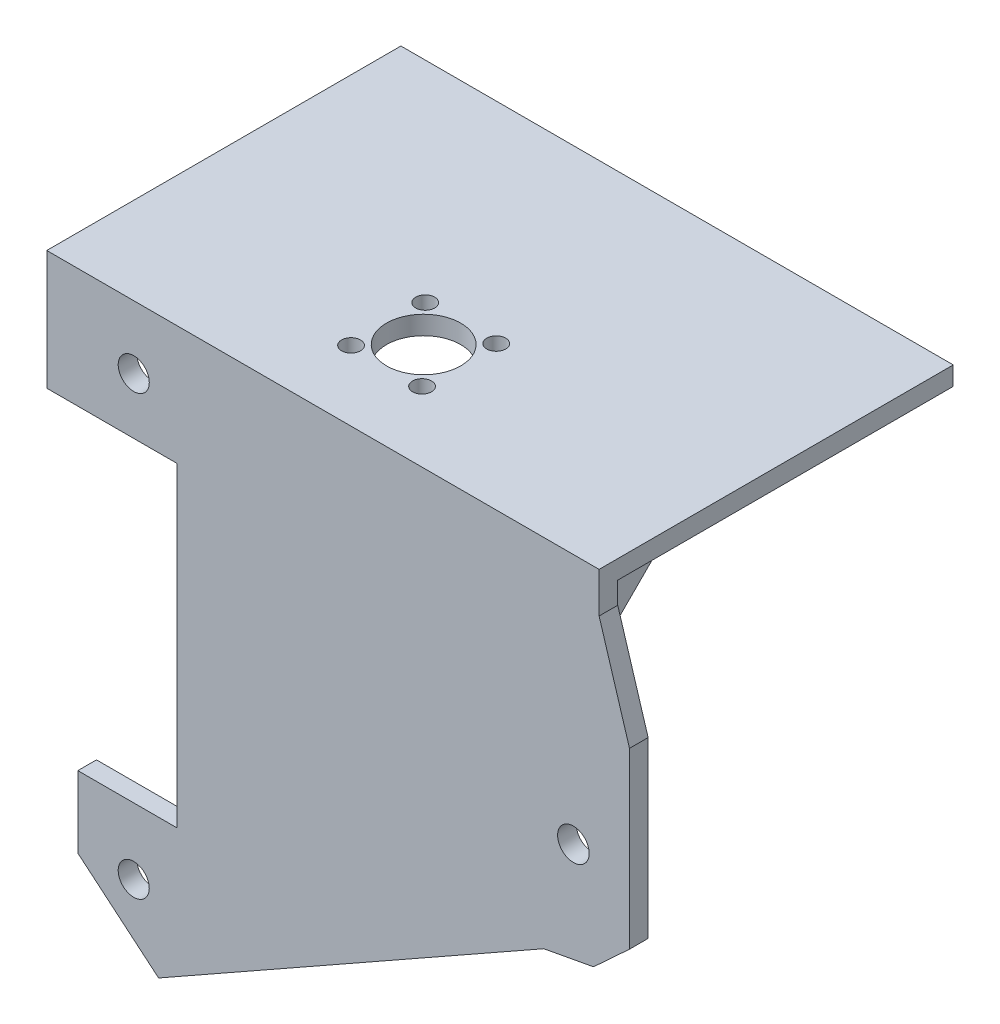
ISO-10303-21;
HEADER;
FILE_DESCRIPTION(('STEP AP214'),'2;1');
FILE_NAME('part.step','',(''),(''),'','','');
FILE_SCHEMA(('AUTOMOTIVE_DESIGN { 1 0 10303 214 1 1 1 1 }'));
ENDSEC;
DATA;
#1=APPLICATION_CONTEXT('core data for automotive mechanical design processes');
#2=APPLICATION_PROTOCOL_DEFINITION('international standard','automotive_design',2000,#1);
#3=PRODUCT_CONTEXT('',#1,'mechanical');
#4=PRODUCT('Part','Part','',(#3));
#5=PRODUCT_RELATED_PRODUCT_CATEGORY('part','',(#4));
#6=PRODUCT_DEFINITION_FORMATION('','',#4);
#7=PRODUCT_DEFINITION_CONTEXT('part definition',#1,'design');
#8=PRODUCT_DEFINITION('design','',#6,#7);
#9=PRODUCT_DEFINITION_SHAPE('','',#8);
#10=(LENGTH_UNIT() NAMED_UNIT(*) SI_UNIT(.MILLI.,.METRE.));
#11=(NAMED_UNIT(*) PLANE_ANGLE_UNIT() SI_UNIT($,.RADIAN.));
#12=(NAMED_UNIT(*) SI_UNIT($,.STERADIAN.) SOLID_ANGLE_UNIT());
#13=UNCERTAINTY_MEASURE_WITH_UNIT(LENGTH_MEASURE(1.E-05),#10,'distance_accuracy_value','');
#14=(GEOMETRIC_REPRESENTATION_CONTEXT(3) GLOBAL_UNCERTAINTY_ASSIGNED_CONTEXT((#13)) GLOBAL_UNIT_ASSIGNED_CONTEXT((#10,
#11,#12)) REPRESENTATION_CONTEXT('',''));
#15=CARTESIAN_POINT('',(0.,0.,0.));
#16=DIRECTION('',(0.,0.,1.));
#17=DIRECTION('',(1.,0.,0.));
#18=AXIS2_PLACEMENT_3D('',#15,#16,#17);
#19=CARTESIAN_POINT('',(1.39999999999998,-11.5,0.));
#20=DIRECTION('',(0.,-0.707106781186547,-0.707106781186548));
#21=DIRECTION('',(0.,0.707106781186548,-0.707106781186547));
#22=AXIS2_PLACEMENT_3D('',#19,#20,#21);
#23=PLANE('',#22);
#24=DIRECTION('',(1.,0.,0.));
#25=VECTOR('',#24,1.);
#26=CARTESIAN_POINT('',(1.39999999999998,-11.5,0.));
#27=LINE('',#26,#25);
#28=CARTESIAN_POINT('',(81.4,-11.5,0.));
#29=VERTEX_POINT('',#28);
#30=CARTESIAN_POINT('',(85.9,-11.5,0.));
#31=VERTEX_POINT('',#30);
#32=EDGE_CURVE('E195',#29,#31,#27,.T.);
#33=ORIENTED_EDGE('',*,*,#32,.F.);
#34=DIRECTION('',(0.,0.707106781186548,-0.707106781186547));
#35=VECTOR('',#34,1.);
#36=CARTESIAN_POINT('',(81.4,-11.5,0.));
#37=LINE('',#36,#35);
#38=CARTESIAN_POINT('',(81.4,0.,-11.5));
#39=VERTEX_POINT('',#38);
#40=EDGE_CURVE('E11',#29,#39,#37,.T.);
#41=ORIENTED_EDGE('',*,*,#40,.T.);
#42=DIRECTION('',(1.,0.,0.));
#43=VECTOR('',#42,1.);
#44=CARTESIAN_POINT('',(1.39999999999998,0.,-11.5));
#45=LINE('',#44,#43);
#46=CARTESIAN_POINT('',(85.9,0.,-11.5));
#47=VERTEX_POINT('',#46);
#48=EDGE_CURVE('E204',#39,#47,#45,.T.);
#49=ORIENTED_EDGE('',*,*,#48,.T.);
#50=DIRECTION('',(0.,0.707106781186548,-0.707106781186547));
#51=VECTOR('',#50,1.);
#52=CARTESIAN_POINT('',(85.9,-11.5,0.));
#53=LINE('',#52,#51);
#54=EDGE_CURVE('E209',#31,#47,#53,.T.);
#55=ORIENTED_EDGE('',*,*,#54,.F.);
#56=EDGE_LOOP('',(#33,#41,#49,#55));
#57=FACE_BOUND('',#56,.T.);
#58=ADVANCED_FACE('F33',(#57),#23,.T.);
#59=CARTESIAN_POINT('',(1.39999999999998,0.,-11.5));
#60=VERTEX_POINT('',#59);
#61=CARTESIAN_POINT('',(6.39999999999999,0.,-11.5));
#62=VERTEX_POINT('',#61);
#63=EDGE_CURVE('E191',#60,#62,#45,.T.);
#64=ORIENTED_EDGE('',*,*,#63,.T.);
#65=DIRECTION('',(0.,-0.707106781186548,0.707106781186547));
#66=VECTOR('',#65,1.);
#67=CARTESIAN_POINT('',(6.39999999999999,-11.5,0.));
#68=LINE('',#67,#66);
#69=CARTESIAN_POINT('',(6.39999999999999,-11.5,0.));
#70=VERTEX_POINT('',#69);
#71=EDGE_CURVE('E41',#62,#70,#68,.T.);
#72=ORIENTED_EDGE('',*,*,#71,.T.);
#73=CARTESIAN_POINT('',(1.39999999999998,-11.5,0.));
#74=VERTEX_POINT('',#73);
#75=EDGE_CURVE('E189',#74,#70,#27,.T.);
#76=ORIENTED_EDGE('',*,*,#75,.F.);
#77=DIRECTION('',(0.,0.707106781186548,-0.707106781186547));
#78=VECTOR('',#77,1.);
#79=CARTESIAN_POINT('',(1.39999999999998,-11.5,0.));
#80=LINE('',#79,#78);
#81=EDGE_CURVE('E382',#74,#60,#80,.T.);
#82=ORIENTED_EDGE('',*,*,#81,.T.);
#83=EDGE_LOOP('',(#64,#72,#76,#82));
#84=FACE_BOUND('',#83,.T.);
#85=ADVANCED_FACE('F187',(#84),#23,.T.);
#86=CARTESIAN_POINT('',(0.,0.,0.));
#87=DIRECTION('',(0.,0.,1.));
#88=DIRECTION('',(1.,0.,0.));
#89=AXIS2_PLACEMENT_3D('',#86,#87,#88);
#90=PLANE('',#89);
#91=CARTESIAN_POINT('',(14.,-77.66,0.));
#92=DIRECTION('',(0.,0.,1.));
#93=DIRECTION('',(1.,0.,0.));
#94=AXIS2_PLACEMENT_3D('',#91,#92,#93);
#95=CIRCLE('',#94,2.5);
#96=CARTESIAN_POINT('',(16.5,-77.66,0.));
#97=VERTEX_POINT('',#96);
#98=EDGE_CURVE('E408',#97,#97,#95,.T.);
#99=ORIENTED_EDGE('',*,*,#98,.T.);
#100=EDGE_LOOP('',(#99));
#101=FACE_BOUND('',#100,.T.);
#102=CARTESIAN_POINT('',(84.763,-37.386,0.));
#103=DIRECTION('',(0.,0.,1.));
#104=DIRECTION('',(1.,0.,0.));
#105=AXIS2_PLACEMENT_3D('',#102,#103,#104);
#106=CIRCLE('',#105,2.54);
#107=CARTESIAN_POINT('',(87.303,-37.386,0.));
#108=VERTEX_POINT('',#107);
#109=EDGE_CURVE('E411',#108,#108,#106,.T.);
#110=ORIENTED_EDGE('',*,*,#109,.T.);
#111=EDGE_LOOP('',(#110));
#112=FACE_BOUND('',#111,.T.);
#113=CARTESIAN_POINT('',(14.,-7.16,0.));
#114=DIRECTION('',(0.,0.,1.));
#115=DIRECTION('',(1.,0.,0.));
#116=AXIS2_PLACEMENT_3D('',#113,#114,#115);
#117=CIRCLE('',#116,2.5);
#118=CARTESIAN_POINT('',(16.5,-7.16,0.));
#119=VERTEX_POINT('',#118);
#120=EDGE_CURVE('E414',#119,#119,#117,.T.);
#121=ORIENTED_EDGE('',*,*,#120,.T.);
#122=EDGE_LOOP('',(#121));
#123=FACE_BOUND('',#122,.T.);
#124=DIRECTION('',(0.,-1.,0.));
#125=VECTOR('',#124,1.);
#126=CARTESIAN_POINT('',(1.39999999999998,0.,0.));
#127=LINE('',#126,#125);
#128=CARTESIAN_POINT('',(1.39999999999998,0.,0.));
#129=VERTEX_POINT('',#128);
#130=EDGE_CURVE('E55',#129,#74,#127,.T.);
#131=ORIENTED_EDGE('',*,*,#130,.T.);
#132=ORIENTED_EDGE('',*,*,#75,.T.);
#133=DIRECTION('',(0.,1.,0.));
#134=VECTOR('',#133,1.);
#135=CARTESIAN_POINT('',(6.39999999999999,-11.5,0.));
#136=LINE('',#135,#134);
#137=CARTESIAN_POINT('',(6.39999999999999,0.,0.));
#138=VERTEX_POINT('',#137);
#139=EDGE_CURVE('E177',#70,#138,#136,.T.);
#140=ORIENTED_EDGE('',*,*,#139,.T.);
#141=DIRECTION('',(1.,0.,0.));
#142=VECTOR('',#141,1.);
#143=CARTESIAN_POINT('',(81.4,0.,0.));
#144=LINE('',#143,#142);
#145=CARTESIAN_POINT('',(81.4,0.,0.));
#146=VERTEX_POINT('',#145);
#147=EDGE_CURVE('E183',#138,#146,#144,.T.);
#148=ORIENTED_EDGE('',*,*,#147,.T.);
#149=DIRECTION('',(0.,-1.,0.));
#150=VECTOR('',#149,1.);
#151=CARTESIAN_POINT('',(81.4,-11.5,0.));
#152=LINE('',#151,#150);
#153=EDGE_CURVE('E48',#146,#29,#152,.T.);
#154=ORIENTED_EDGE('',*,*,#153,.T.);
#155=ORIENTED_EDGE('',*,*,#32,.T.);
#156=DIRECTION('',(0.,-1.,0.));
#157=VECTOR('',#156,1.);
#158=CARTESIAN_POINT('',(85.9,0.,0.));
#159=LINE('',#158,#157);
#160=CARTESIAN_POINT('',(85.9,0.,0.));
#161=VERTEX_POINT('',#160);
#162=EDGE_CURVE('E202',#161,#31,#159,.T.);
#163=ORIENTED_EDGE('',*,*,#162,.F.);
#164=DIRECTION('',(-1.,0.,0.));
#165=VECTOR('',#164,1.);
#166=CARTESIAN_POINT('',(0.,0.,0.));
#167=LINE('',#166,#165);
#168=CARTESIAN_POINT('',(88.9,0.,0.));
#169=VERTEX_POINT('',#168);
#170=EDGE_CURVE('E261',#169,#161,#167,.T.);
#171=ORIENTED_EDGE('',*,*,#170,.F.);
#172=DIRECTION('',(0.,1.,0.));
#173=VECTOR('',#172,1.);
#174=CARTESIAN_POINT('',(88.9,0.,0.));
#175=LINE('',#174,#173);
#176=CARTESIAN_POINT('',(88.9,-3.5,0.));
#177=VERTEX_POINT('',#176);
#178=EDGE_CURVE('E306',#177,#169,#175,.T.);
#179=ORIENTED_EDGE('',*,*,#178,.F.);
#180=DIRECTION('',(-0.292371704722738,0.956304755963035,0.));
#181=VECTOR('',#180,1.);
#182=CARTESIAN_POINT('',(88.9,-3.5,0.));
#183=LINE('',#182,#181);
#184=CARTESIAN_POINT('',(93.7916909033386,-19.5,0.));
#185=VERTEX_POINT('',#184);
#186=EDGE_CURVE('E304',#185,#177,#183,.T.);
#187=ORIENTED_EDGE('',*,*,#186,.F.);
#188=DIRECTION('',(0.,1.,0.));
#189=VECTOR('',#188,1.);
#190=CARTESIAN_POINT('',(93.7916909033386,-19.5,0.));
#191=LINE('',#190,#189);
#192=CARTESIAN_POINT('',(93.7916909033386,-47.5,0.));
#193=VERTEX_POINT('',#192);
#194=EDGE_CURVE('E302',#193,#185,#191,.T.);
#195=ORIENTED_EDGE('',*,*,#194,.F.);
#196=DIRECTION('',(0.734708955038992,0.678382452150343,0.));
#197=VECTOR('',#196,1.);
#198=CARTESIAN_POINT('',(88.,-52.84767059821,0.));
#199=LINE('',#198,#197);
#200=CARTESIAN_POINT('',(88.,-52.84767059821,0.));
#201=VERTEX_POINT('',#200);
#202=EDGE_CURVE('E300',#201,#193,#199,.T.);
#203=ORIENTED_EDGE('',*,*,#202,.F.);
#204=DIRECTION('',(0.983254907563954,0.182235525492152,0.));
#205=VECTOR('',#204,1.);
#206=CARTESIAN_POINT('',(80.,-54.3303829576624,0.));
#207=LINE('',#206,#205);
#208=CARTESIAN_POINT('',(80.,-54.3303829576624,0.));
#209=VERTEX_POINT('',#208);
#210=EDGE_CURVE('E298',#209,#201,#207,.T.);
#211=ORIENTED_EDGE('',*,*,#210,.F.);
#212=DIRECTION('',(0.870355695939897,0.492423560103472,0.));
#213=VECTOR('',#212,1.);
#214=CARTESIAN_POINT('',(18.,-89.4082952053046,0.));
#215=LINE('',#214,#213);
#216=CARTESIAN_POINT('',(18.,-89.4082952053046,0.));
#217=VERTEX_POINT('',#216);
#218=EDGE_CURVE('E296',#217,#209,#215,.T.);
#219=ORIENTED_EDGE('',*,*,#218,.F.);
#220=DIRECTION('',(0.76604444311898,-0.642787609686537,0.));
#221=VECTOR('',#220,1.);
#222=CARTESIAN_POINT('',(5.00000000000001,-78.5,0.));
#223=LINE('',#222,#221);
#224=CARTESIAN_POINT('',(5.00000000000001,-78.5,0.));
#225=VERTEX_POINT('',#224);
#226=EDGE_CURVE('E294',#225,#217,#223,.T.);
#227=ORIENTED_EDGE('',*,*,#226,.F.);
#228=DIRECTION('',(0.,-1.,0.));
#229=VECTOR('',#228,1.);
#230=CARTESIAN_POINT('',(5.00000000000001,-67.,0.));
#231=LINE('',#230,#229);
#232=CARTESIAN_POINT('',(5.00000000000001,-67.,0.));
#233=VERTEX_POINT('',#232);
#234=EDGE_CURVE('E292',#233,#225,#231,.T.);
#235=ORIENTED_EDGE('',*,*,#234,.F.);
#236=DIRECTION('',(-1.,0.,0.));
#237=VECTOR('',#236,1.);
#238=CARTESIAN_POINT('',(21.,-67.,0.));
#239=LINE('',#238,#237);
#240=CARTESIAN_POINT('',(21.,-67.,0.));
#241=VERTEX_POINT('',#240);
#242=EDGE_CURVE('E290',#241,#233,#239,.T.);
#243=ORIENTED_EDGE('',*,*,#242,.F.);
#244=DIRECTION('',(0.,-1.,0.));
#245=VECTOR('',#244,1.);
#246=CARTESIAN_POINT('',(21.,-16.2,0.));
#247=LINE('',#246,#245);
#248=CARTESIAN_POINT('',(21.,-16.2,0.));
#249=VERTEX_POINT('',#248);
#250=EDGE_CURVE('E288',#249,#241,#247,.T.);
#251=ORIENTED_EDGE('',*,*,#250,.F.);
#252=DIRECTION('',(1.,0.,0.));
#253=VECTOR('',#252,1.);
#254=CARTESIAN_POINT('',(0.,-16.2,0.));
#255=LINE('',#254,#253);
#256=CARTESIAN_POINT('',(0.,-16.2,0.));
#257=VERTEX_POINT('',#256);
#258=EDGE_CURVE('E286',#257,#249,#255,.T.);
#259=ORIENTED_EDGE('',*,*,#258,.F.);
#260=DIRECTION('',(0.,-1.,0.));
#261=VECTOR('',#260,1.);
#262=CARTESIAN_POINT('',(0.,0.,0.));
#263=LINE('',#262,#261);
#264=CARTESIAN_POINT('',(0.,0.,0.));
#265=VERTEX_POINT('',#264);
#266=EDGE_CURVE('E256',#265,#257,#263,.T.);
#267=ORIENTED_EDGE('',*,*,#266,.F.);
#268=EDGE_CURVE('E308',#129,#265,#167,.T.);
#269=ORIENTED_EDGE('',*,*,#268,.F.);
#270=EDGE_LOOP('',(#131,#132,#140,#148,#154,#155,#163,#171,#179,#187,#195,#203,#211,#219,#227,
#235,#243,#251,#259,#267,#269));
#271=FACE_BOUND('',#270,.T.);
#272=ADVANCED_FACE('F193',(#101,#112,#123,#271),#90,.F.);
#273=CARTESIAN_POINT('',(0.,0.,3.));
#274=DIRECTION('',(1.,0.,0.));
#275=DIRECTION('',(0.,1.,0.));
#276=AXIS2_PLACEMENT_3D('',#273,#274,#275);
#277=PLANE('',#276);
#278=ORIENTED_EDGE('',*,*,#266,.T.);
#279=DIRECTION('',(0.,0.,-1.));
#280=VECTOR('',#279,1.);
#281=CARTESIAN_POINT('',(0.,-16.2,3.));
#282=LINE('',#281,#280);
#283=CARTESIAN_POINT('',(0.,-16.2,3.));
#284=VERTEX_POINT('',#283);
#285=EDGE_CURVE('E192',#284,#257,#282,.T.);
#286=ORIENTED_EDGE('',*,*,#285,.F.);
#287=DIRECTION('',(0.,-1.,0.));
#288=VECTOR('',#287,1.);
#289=CARTESIAN_POINT('',(0.,0.,3.));
#290=LINE('',#289,#288);
#291=CARTESIAN_POINT('',(0.,3.,3.));
#292=VERTEX_POINT('',#291);
#293=EDGE_CURVE('E257',#292,#284,#290,.T.);
#294=ORIENTED_EDGE('',*,*,#293,.F.);
#295=DIRECTION('',(0.,0.,1.));
#296=VECTOR('',#295,1.);
#297=CARTESIAN_POINT('',(0.,3.,3.));
#298=LINE('',#297,#296);
#299=CARTESIAN_POINT('',(0.,3.,-54.));
#300=VERTEX_POINT('',#299);
#301=EDGE_CURVE('E234',#300,#292,#298,.T.);
#302=ORIENTED_EDGE('',*,*,#301,.F.);
#303=DIRECTION('',(0.,-1.,0.));
#304=VECTOR('',#303,1.);
#305=CARTESIAN_POINT('',(0.,3.,-54.));
#306=LINE('',#305,#304);
#307=CARTESIAN_POINT('',(0.,0.,-54.));
#308=VERTEX_POINT('',#307);
#309=EDGE_CURVE('E245',#300,#308,#306,.T.);
#310=ORIENTED_EDGE('',*,*,#309,.T.);
#311=DIRECTION('',(0.,0.,1.));
#312=VECTOR('',#311,1.);
#313=CARTESIAN_POINT('',(0.,0.,3.));
#314=LINE('',#313,#312);
#315=EDGE_CURVE('E231',#308,#265,#314,.T.);
#316=ORIENTED_EDGE('',*,*,#315,.T.);
#317=EDGE_LOOP('',(#278,#286,#294,#302,#310,#316));
#318=FACE_BOUND('',#317,.T.);
#319=ADVANCED_FACE('F35',(#318),#277,.F.);
#320=CARTESIAN_POINT('',(0.,-16.2,3.));
#321=DIRECTION('',(0.,1.,0.));
#322=DIRECTION('',(0.,0.,1.));
#323=AXIS2_PLACEMENT_3D('',#320,#321,#322);
#324=PLANE('',#323);
#325=ORIENTED_EDGE('',*,*,#258,.T.);
#326=DIRECTION('',(0.,0.,-1.));
#327=VECTOR('',#326,1.);
#328=CARTESIAN_POINT('',(21.,-16.2,3.));
#329=LINE('',#328,#327);
#330=CARTESIAN_POINT('',(21.,-16.2,3.));
#331=VERTEX_POINT('',#330);
#332=EDGE_CURVE('E337',#331,#249,#329,.T.);
#333=ORIENTED_EDGE('',*,*,#332,.F.);
#334=DIRECTION('',(1.,0.,0.));
#335=VECTOR('',#334,1.);
#336=CARTESIAN_POINT('',(0.,-16.2,3.));
#337=LINE('',#336,#335);
#338=EDGE_CURVE('E260',#284,#331,#337,.T.);
#339=ORIENTED_EDGE('',*,*,#338,.F.);
#340=ORIENTED_EDGE('',*,*,#285,.T.);
#341=EDGE_LOOP('',(#325,#333,#339,#340));
#342=FACE_BOUND('',#341,.T.);
#343=ADVANCED_FACE('F343',(#342),#324,.F.);
#344=CARTESIAN_POINT('',(21.,-16.2,3.));
#345=DIRECTION('',(1.,0.,0.));
#346=DIRECTION('',(0.,1.,0.));
#347=AXIS2_PLACEMENT_3D('',#344,#345,#346);
#348=PLANE('',#347);
#349=ORIENTED_EDGE('',*,*,#250,.T.);
#350=DIRECTION('',(0.,0.,-1.));
#351=VECTOR('',#350,1.);
#352=CARTESIAN_POINT('',(21.,-67.,3.));
#353=LINE('',#352,#351);
#354=CARTESIAN_POINT('',(21.,-67.,3.));
#355=VERTEX_POINT('',#354);
#356=EDGE_CURVE('E334',#355,#241,#353,.T.);
#357=ORIENTED_EDGE('',*,*,#356,.F.);
#358=DIRECTION('',(0.,-1.,0.));
#359=VECTOR('',#358,1.);
#360=CARTESIAN_POINT('',(21.,-16.2,3.));
#361=LINE('',#360,#359);
#362=EDGE_CURVE('E263',#331,#355,#361,.T.);
#363=ORIENTED_EDGE('',*,*,#362,.F.);
#364=ORIENTED_EDGE('',*,*,#332,.T.);
#365=EDGE_LOOP('',(#349,#357,#363,#364));
#366=FACE_BOUND('',#365,.T.);
#367=ADVANCED_FACE('F353',(#366),#348,.F.);
#368=CARTESIAN_POINT('',(21.,-67.,3.));
#369=DIRECTION('',(0.,-1.,0.));
#370=DIRECTION('',(0.,0.,-1.));
#371=AXIS2_PLACEMENT_3D('',#368,#369,#370);
#372=PLANE('',#371);
#373=ORIENTED_EDGE('',*,*,#242,.T.);
#374=DIRECTION('',(0.,0.,-1.));
#375=VECTOR('',#374,1.);
#376=CARTESIAN_POINT('',(5.00000000000001,-67.,3.));
#377=LINE('',#376,#375);
#378=CARTESIAN_POINT('',(5.00000000000001,-67.,3.));
#379=VERTEX_POINT('',#378);
#380=EDGE_CURVE('E331',#379,#233,#377,.T.);
#381=ORIENTED_EDGE('',*,*,#380,.F.);
#382=DIRECTION('',(-1.,0.,0.));
#383=VECTOR('',#382,1.);
#384=CARTESIAN_POINT('',(21.,-67.,3.));
#385=LINE('',#384,#383);
#386=EDGE_CURVE('E265',#355,#379,#385,.T.);
#387=ORIENTED_EDGE('',*,*,#386,.F.);
#388=ORIENTED_EDGE('',*,*,#356,.T.);
#389=EDGE_LOOP('',(#373,#381,#387,#388));
#390=FACE_BOUND('',#389,.T.);
#391=ADVANCED_FACE('F357',(#390),#372,.F.);
#392=CARTESIAN_POINT('',(5.00000000000001,-67.,3.));
#393=DIRECTION('',(1.,0.,0.));
#394=DIRECTION('',(0.,1.,0.));
#395=AXIS2_PLACEMENT_3D('',#392,#393,#394);
#396=PLANE('',#395);
#397=ORIENTED_EDGE('',*,*,#234,.T.);
#398=DIRECTION('',(0.,0.,-1.));
#399=VECTOR('',#398,1.);
#400=CARTESIAN_POINT('',(5.00000000000001,-78.5,3.));
#401=LINE('',#400,#399);
#402=CARTESIAN_POINT('',(5.00000000000001,-78.5,3.));
#403=VERTEX_POINT('',#402);
#404=EDGE_CURVE('E328',#403,#225,#401,.T.);
#405=ORIENTED_EDGE('',*,*,#404,.F.);
#406=DIRECTION('',(0.,-1.,0.));
#407=VECTOR('',#406,1.);
#408=CARTESIAN_POINT('',(5.00000000000001,-67.,3.));
#409=LINE('',#408,#407);
#410=EDGE_CURVE('E267',#379,#403,#409,.T.);
#411=ORIENTED_EDGE('',*,*,#410,.F.);
#412=ORIENTED_EDGE('',*,*,#380,.T.);
#413=EDGE_LOOP('',(#397,#405,#411,#412));
#414=FACE_BOUND('',#413,.T.);
#415=ADVANCED_FACE('F676',(#414),#396,.F.);
#416=CARTESIAN_POINT('',(5.00000000000001,-78.5,3.));
#417=DIRECTION('',(0.642787609686537,0.76604444311898,0.));
#418=DIRECTION('',(-0.76604444311898,0.642787609686537,0.));
#419=AXIS2_PLACEMENT_3D('',#416,#417,#418);
#420=PLANE('',#419);
#421=ORIENTED_EDGE('',*,*,#226,.T.);
#422=DIRECTION('',(0.,0.,-1.));
#423=VECTOR('',#422,1.);
#424=CARTESIAN_POINT('',(18.,-89.4082952053046,3.));
#425=LINE('',#424,#423);
#426=CARTESIAN_POINT('',(18.,-89.4082952053046,3.));
#427=VERTEX_POINT('',#426);
#428=EDGE_CURVE('E325',#427,#217,#425,.T.);
#429=ORIENTED_EDGE('',*,*,#428,.F.);
#430=DIRECTION('',(0.76604444311898,-0.642787609686537,0.));
#431=VECTOR('',#430,1.);
#432=CARTESIAN_POINT('',(5.00000000000001,-78.5,3.));
#433=LINE('',#432,#431);
#434=EDGE_CURVE('E269',#403,#427,#433,.T.);
#435=ORIENTED_EDGE('',*,*,#434,.F.);
#436=ORIENTED_EDGE('',*,*,#404,.T.);
#437=EDGE_LOOP('',(#421,#429,#435,#436));
#438=FACE_BOUND('',#437,.T.);
#439=ADVANCED_FACE('F666',(#438),#420,.F.);
#440=CARTESIAN_POINT('',(18.,-89.4082952053046,3.));
#441=DIRECTION('',(-0.492423560103472,0.870355695939897,0.));
#442=DIRECTION('',(-0.870355695939897,-0.492423560103472,0.));
#443=AXIS2_PLACEMENT_3D('',#440,#441,#442);
#444=PLANE('',#443);
#445=ORIENTED_EDGE('',*,*,#218,.T.);
#446=DIRECTION('',(0.,0.,-1.));
#447=VECTOR('',#446,1.);
#448=CARTESIAN_POINT('',(80.,-54.3303829576624,3.));
#449=LINE('',#448,#447);
#450=CARTESIAN_POINT('',(80.,-54.3303829576624,3.));
#451=VERTEX_POINT('',#450);
#452=EDGE_CURVE('E322',#451,#209,#449,.T.);
#453=ORIENTED_EDGE('',*,*,#452,.F.);
#454=DIRECTION('',(0.870355695939897,0.492423560103472,0.));
#455=VECTOR('',#454,1.);
#456=CARTESIAN_POINT('',(18.,-89.4082952053046,3.));
#457=LINE('',#456,#455);
#458=EDGE_CURVE('E271',#427,#451,#457,.T.);
#459=ORIENTED_EDGE('',*,*,#458,.F.);
#460=ORIENTED_EDGE('',*,*,#428,.T.);
#461=EDGE_LOOP('',(#445,#453,#459,#460));
#462=FACE_BOUND('',#461,.T.);
#463=ADVANCED_FACE('F656',(#462),#444,.F.);
#464=CARTESIAN_POINT('',(80.,-54.3303829576624,3.));
#465=DIRECTION('',(-0.182235525492152,0.983254907563954,0.));
#466=DIRECTION('',(-0.983254907563954,-0.182235525492152,0.));
#467=AXIS2_PLACEMENT_3D('',#464,#465,#466);
#468=PLANE('',#467);
#469=ORIENTED_EDGE('',*,*,#210,.T.);
#470=DIRECTION('',(0.,0.,-1.));
#471=VECTOR('',#470,1.);
#472=CARTESIAN_POINT('',(88.,-52.84767059821,3.));
#473=LINE('',#472,#471);
#474=CARTESIAN_POINT('',(88.,-52.84767059821,3.));
#475=VERTEX_POINT('',#474);
#476=EDGE_CURVE('E319',#475,#201,#473,.T.);
#477=ORIENTED_EDGE('',*,*,#476,.F.);
#478=DIRECTION('',(0.983254907563954,0.182235525492152,0.));
#479=VECTOR('',#478,1.);
#480=CARTESIAN_POINT('',(80.,-54.3303829576624,3.));
#481=LINE('',#480,#479);
#482=EDGE_CURVE('E273',#451,#475,#481,.T.);
#483=ORIENTED_EDGE('',*,*,#482,.F.);
#484=ORIENTED_EDGE('',*,*,#452,.T.);
#485=EDGE_LOOP('',(#469,#477,#483,#484));
#486=FACE_BOUND('',#485,.T.);
#487=ADVANCED_FACE('F646',(#486),#468,.F.);
#488=CARTESIAN_POINT('',(88.,-52.84767059821,3.));
#489=DIRECTION('',(-0.678382452150343,0.734708955038992,0.));
#490=DIRECTION('',(-0.734708955038992,-0.678382452150343,0.));
#491=AXIS2_PLACEMENT_3D('',#488,#489,#490);
#492=PLANE('',#491);
#493=ORIENTED_EDGE('',*,*,#202,.T.);
#494=DIRECTION('',(0.,0.,-1.));
#495=VECTOR('',#494,1.);
#496=CARTESIAN_POINT('',(93.7916909033386,-47.5,3.));
#497=LINE('',#496,#495);
#498=CARTESIAN_POINT('',(93.7916909033386,-47.5,3.));
#499=VERTEX_POINT('',#498);
#500=EDGE_CURVE('E316',#499,#193,#497,.T.);
#501=ORIENTED_EDGE('',*,*,#500,.F.);
#502=DIRECTION('',(0.734708955038992,0.678382452150343,0.));
#503=VECTOR('',#502,1.);
#504=CARTESIAN_POINT('',(88.,-52.84767059821,3.));
#505=LINE('',#504,#503);
#506=EDGE_CURVE('E275',#475,#499,#505,.T.);
#507=ORIENTED_EDGE('',*,*,#506,.F.);
#508=ORIENTED_EDGE('',*,*,#476,.T.);
#509=EDGE_LOOP('',(#493,#501,#507,#508));
#510=FACE_BOUND('',#509,.T.);
#511=ADVANCED_FACE('F636',(#510),#492,.F.);
#512=CARTESIAN_POINT('',(93.7916909033386,-19.5,3.));
#513=DIRECTION('',(-1.,0.,0.));
#514=DIRECTION('',(0.,-1.,0.));
#515=AXIS2_PLACEMENT_3D('',#512,#513,#514);
#516=PLANE('',#515);
#517=ORIENTED_EDGE('',*,*,#194,.T.);
#518=DIRECTION('',(0.,0.,-1.));
#519=VECTOR('',#518,1.);
#520=CARTESIAN_POINT('',(93.7916909033386,-19.5,3.));
#521=LINE('',#520,#519);
#522=CARTESIAN_POINT('',(93.7916909033386,-19.5,3.));
#523=VERTEX_POINT('',#522);
#524=EDGE_CURVE('E313',#523,#185,#521,.T.);
#525=ORIENTED_EDGE('',*,*,#524,.F.);
#526=DIRECTION('',(0.,1.,0.));
#527=VECTOR('',#526,1.);
#528=CARTESIAN_POINT('',(93.7916909033386,-19.5,3.));
#529=LINE('',#528,#527);
#530=EDGE_CURVE('E277',#499,#523,#529,.T.);
#531=ORIENTED_EDGE('',*,*,#530,.F.);
#532=ORIENTED_EDGE('',*,*,#500,.T.);
#533=EDGE_LOOP('',(#517,#525,#531,#532));
#534=FACE_BOUND('',#533,.T.);
#535=ADVANCED_FACE('F626',(#534),#516,.F.);
#536=CARTESIAN_POINT('',(88.9,-3.5,3.));
#537=DIRECTION('',(-0.956304755963035,-0.292371704722738,0.));
#538=DIRECTION('',(0.292371704722738,-0.956304755963035,0.));
#539=AXIS2_PLACEMENT_3D('',#536,#537,#538);
#540=PLANE('',#539);
#541=ORIENTED_EDGE('',*,*,#186,.T.);
#542=DIRECTION('',(0.,0.,-1.));
#543=VECTOR('',#542,1.);
#544=CARTESIAN_POINT('',(88.9,-3.5,3.));
#545=LINE('',#544,#543);
#546=CARTESIAN_POINT('',(88.9,-3.5,3.));
#547=VERTEX_POINT('',#546);
#548=EDGE_CURVE('E283',#547,#177,#545,.T.);
#549=ORIENTED_EDGE('',*,*,#548,.F.);
#550=DIRECTION('',(-0.292371704722738,0.956304755963035,0.));
#551=VECTOR('',#550,1.);
#552=CARTESIAN_POINT('',(88.9,-3.5,3.));
#553=LINE('',#552,#551);
#554=EDGE_CURVE('E279',#523,#547,#553,.T.);
#555=ORIENTED_EDGE('',*,*,#554,.F.);
#556=ORIENTED_EDGE('',*,*,#524,.T.);
#557=EDGE_LOOP('',(#541,#549,#555,#556));
#558=FACE_BOUND('',#557,.T.);
#559=ADVANCED_FACE('F610',(#558),#540,.F.);
#560=CARTESIAN_POINT('',(88.9,0.,3.));
#561=DIRECTION('',(-1.,0.,0.));
#562=DIRECTION('',(0.,0.,1.));
#563=AXIS2_PLACEMENT_3D('',#560,#561,#562);
#564=PLANE('',#563);
#565=ORIENTED_EDGE('',*,*,#178,.T.);
#566=DIRECTION('',(0.,0.,-1.));
#567=VECTOR('',#566,1.);
#568=CARTESIAN_POINT('',(88.9,0.,3.));
#569=LINE('',#568,#567);
#570=CARTESIAN_POINT('',(88.9,0.,-54.));
#571=VERTEX_POINT('',#570);
#572=EDGE_CURVE('E248',#169,#571,#569,.T.);
#573=ORIENTED_EDGE('',*,*,#572,.T.);
#574=DIRECTION('',(0.,-1.,0.));
#575=VECTOR('',#574,1.);
#576=CARTESIAN_POINT('',(88.9,3.,-54.));
#577=LINE('',#576,#575);
#578=CARTESIAN_POINT('',(88.9,3.,-54.));
#579=VERTEX_POINT('',#578);
#580=EDGE_CURVE('E253',#579,#571,#577,.T.);
#581=ORIENTED_EDGE('',*,*,#580,.F.);
#582=DIRECTION('',(0.,0.,-1.));
#583=VECTOR('',#582,1.);
#584=CARTESIAN_POINT('',(88.9,3.,3.));
#585=LINE('',#584,#583);
#586=CARTESIAN_POINT('',(88.9,3.,3.));
#587=VERTEX_POINT('',#586);
#588=EDGE_CURVE('E241',#587,#579,#585,.T.);
#589=ORIENTED_EDGE('',*,*,#588,.F.);
#590=DIRECTION('',(0.,1.,0.));
#591=VECTOR('',#590,1.);
#592=CARTESIAN_POINT('',(88.9,0.,3.));
#593=LINE('',#592,#591);
#594=EDGE_CURVE('E281',#547,#587,#593,.T.);
#595=ORIENTED_EDGE('',*,*,#594,.F.);
#596=ORIENTED_EDGE('',*,*,#548,.T.);
#597=EDGE_LOOP('',(#565,#573,#581,#589,#595,#596));
#598=FACE_BOUND('',#597,.T.);
#599=ADVANCED_FACE('F432',(#598),#564,.F.);
#600=CARTESIAN_POINT('',(0.,0.,3.));
#601=DIRECTION('',(0.,0.,1.));
#602=DIRECTION('',(1.,0.,0.));
#603=AXIS2_PLACEMENT_3D('',#600,#601,#602);
#604=PLANE('',#603);
#605=CARTESIAN_POINT('',(14.,-77.66,3.));
#606=DIRECTION('',(0.,0.,1.));
#607=DIRECTION('',(1.,0.,0.));
#608=AXIS2_PLACEMENT_3D('',#605,#606,#607);
#609=CIRCLE('',#608,2.5);
#610=CARTESIAN_POINT('',(16.5,-77.66,3.));
#611=VERTEX_POINT('',#610);
#612=EDGE_CURVE('E417',#611,#611,#609,.T.);
#613=ORIENTED_EDGE('',*,*,#612,.F.);
#614=EDGE_LOOP('',(#613));
#615=FACE_BOUND('',#614,.T.);
#616=CARTESIAN_POINT('',(84.763,-37.386,3.));
#617=DIRECTION('',(0.,0.,1.));
#618=DIRECTION('',(1.,0.,0.));
#619=AXIS2_PLACEMENT_3D('',#616,#617,#618);
#620=CIRCLE('',#619,2.54);
#621=CARTESIAN_POINT('',(87.303,-37.386,3.));
#622=VERTEX_POINT('',#621);
#623=EDGE_CURVE('E421',#622,#622,#620,.T.);
#624=ORIENTED_EDGE('',*,*,#623,.F.);
#625=EDGE_LOOP('',(#624));
#626=FACE_BOUND('',#625,.T.);
#627=CARTESIAN_POINT('',(14.,-7.16,3.));
#628=DIRECTION('',(0.,0.,1.));
#629=DIRECTION('',(1.,0.,0.));
#630=AXIS2_PLACEMENT_3D('',#627,#628,#629);
#631=CIRCLE('',#630,2.5);
#632=CARTESIAN_POINT('',(16.5,-7.16,3.));
#633=VERTEX_POINT('',#632);
#634=EDGE_CURVE('E418',#633,#633,#631,.T.);
#635=ORIENTED_EDGE('',*,*,#634,.F.);
#636=EDGE_LOOP('',(#635));
#637=FACE_BOUND('',#636,.T.);
#638=ORIENTED_EDGE('',*,*,#293,.T.);
#639=ORIENTED_EDGE('',*,*,#338,.T.);
#640=ORIENTED_EDGE('',*,*,#362,.T.);
#641=ORIENTED_EDGE('',*,*,#386,.T.);
#642=ORIENTED_EDGE('',*,*,#410,.T.);
#643=ORIENTED_EDGE('',*,*,#434,.T.);
#644=ORIENTED_EDGE('',*,*,#458,.T.);
#645=ORIENTED_EDGE('',*,*,#482,.T.);
#646=ORIENTED_EDGE('',*,*,#506,.T.);
#647=ORIENTED_EDGE('',*,*,#530,.T.);
#648=ORIENTED_EDGE('',*,*,#554,.T.);
#649=ORIENTED_EDGE('',*,*,#594,.T.);
#650=DIRECTION('',(1.,0.,0.));
#651=VECTOR('',#650,1.);
#652=CARTESIAN_POINT('',(0.,3.,3.));
#653=LINE('',#652,#651);
#654=EDGE_CURVE('E237',#292,#587,#653,.T.);
#655=ORIENTED_EDGE('',*,*,#654,.F.);
#656=EDGE_LOOP('',(#638,#639,#640,#641,#642,#643,#644,#645,#646,#647,#648,#649,#655));
#657=FACE_BOUND('',#656,.T.);
#658=ADVANCED_FACE('F361',(#615,#626,#637,#657),#604,.T.);
#659=CARTESIAN_POINT('',(0.,3.,0.));
#660=DIRECTION('',(0.,-1.,0.));
#661=DIRECTION('',(0.,0.,-1.));
#662=AXIS2_PLACEMENT_3D('',#659,#660,#661);
#663=PLANE('',#662);
#664=ORIENTED_EDGE('',*,*,#301,.T.);
#665=ORIENTED_EDGE('',*,*,#654,.T.);
#666=ORIENTED_EDGE('',*,*,#588,.T.);
#667=DIRECTION('',(-1.,0.,0.));
#668=VECTOR('',#667,1.);
#669=CARTESIAN_POINT('',(0.,3.,-54.));
#670=LINE('',#669,#668);
#671=EDGE_CURVE('E243',#579,#300,#670,.T.);
#672=ORIENTED_EDGE('',*,*,#671,.T.);
#673=EDGE_LOOP('',(#664,#665,#666,#672));
#674=FACE_BOUND('',#673,.T.);
#675=CARTESIAN_POINT('',(43.434,3.,-14.224));
#676=DIRECTION('',(0.,1.,0.));
#677=DIRECTION('',(0.,0.,1.));
#678=AXIS2_PLACEMENT_3D('',#675,#676,#677);
#679=CIRCLE('',#678,5.969);
#680=CARTESIAN_POINT('',(43.434,3.,-8.25499999999999));
#681=VERTEX_POINT('',#680);
#682=EDGE_CURVE('E228',#681,#681,#679,.T.);
#683=ORIENTED_EDGE('',*,*,#682,.F.);
#684=EDGE_LOOP('',(#683));
#685=FACE_BOUND('',#684,.T.);
#686=CARTESIAN_POINT('',(37.719,3.,-20.193));
#687=DIRECTION('',(0.,1.,0.));
#688=DIRECTION('',(0.,0.,1.));
#689=AXIS2_PLACEMENT_3D('',#686,#687,#688);
#690=CIRCLE('',#689,1.524);
#691=CARTESIAN_POINT('',(37.719,3.,-18.669));
#692=VERTEX_POINT('',#691);
#693=EDGE_CURVE('E222',#692,#692,#690,.T.);
#694=ORIENTED_EDGE('',*,*,#693,.F.);
#695=EDGE_LOOP('',(#694));
#696=FACE_BOUND('',#695,.T.);
#697=CARTESIAN_POINT('',(49.149,3.,-20.193));
#698=DIRECTION('',(0.,1.,0.));
#699=DIRECTION('',(0.,0.,1.));
#700=AXIS2_PLACEMENT_3D('',#697,#698,#699);
#701=CIRCLE('',#700,1.524);
#702=CARTESIAN_POINT('',(49.149,3.,-18.669));
#703=VERTEX_POINT('',#702);
#704=EDGE_CURVE('E216',#703,#703,#701,.T.);
#705=ORIENTED_EDGE('',*,*,#704,.F.);
#706=EDGE_LOOP('',(#705));
#707=FACE_BOUND('',#706,.T.);
#708=CARTESIAN_POINT('',(37.719,3.,-8.25499999999999));
#709=DIRECTION('',(0.,1.,0.));
#710=DIRECTION('',(0.,0.,1.));
#711=AXIS2_PLACEMENT_3D('',#708,#709,#710);
#712=CIRCLE('',#711,1.524);
#713=CARTESIAN_POINT('',(37.719,3.,-6.73099999999999));
#714=VERTEX_POINT('',#713);
#715=EDGE_CURVE('E198',#714,#714,#712,.T.);
#716=ORIENTED_EDGE('',*,*,#715,.F.);
#717=EDGE_LOOP('',(#716));
#718=FACE_BOUND('',#717,.T.);
#719=CARTESIAN_POINT('',(49.149,3.,-8.25499999999999));
#720=DIRECTION('',(0.,1.,0.));
#721=DIRECTION('',(0.,0.,1.));
#722=AXIS2_PLACEMENT_3D('',#719,#720,#721);
#723=CIRCLE('',#722,1.524);
#724=CARTESIAN_POINT('',(49.149,3.,-6.73099999999999));
#725=VERTEX_POINT('',#724);
#726=EDGE_CURVE('E194',#725,#725,#723,.T.);
#727=ORIENTED_EDGE('',*,*,#726,.F.);
#728=EDGE_LOOP('',(#727));
#729=FACE_BOUND('',#728,.T.);
#730=ADVANCED_FACE('F367',(#674,#685,#696,#707,#718,#729),#663,.F.);
#731=CARTESIAN_POINT('',(0.,0.,0.));
#732=DIRECTION('',(0.,-1.,0.));
#733=DIRECTION('',(0.,0.,-1.));
#734=AXIS2_PLACEMENT_3D('',#731,#732,#733);
#735=PLANE('',#734);
#736=ORIENTED_EDGE('',*,*,#315,.F.);
#737=DIRECTION('',(-1.,0.,0.));
#738=VECTOR('',#737,1.);
#739=CARTESIAN_POINT('',(0.,0.,-54.));
#740=LINE('',#739,#738);
#741=EDGE_CURVE('E238',#571,#308,#740,.T.);
#742=ORIENTED_EDGE('',*,*,#741,.F.);
#743=ORIENTED_EDGE('',*,*,#572,.F.);
#744=ORIENTED_EDGE('',*,*,#170,.T.);
#745=DIRECTION('',(0.,0.,1.));
#746=VECTOR('',#745,1.);
#747=CARTESIAN_POINT('',(85.9,0.,-11.5));
#748=LINE('',#747,#746);
#749=EDGE_CURVE('E389',#47,#161,#748,.T.);
#750=ORIENTED_EDGE('',*,*,#749,.F.);
#751=ORIENTED_EDGE('',*,*,#48,.F.);
#752=DIRECTION('',(0.,0.,1.));
#753=VECTOR('',#752,1.);
#754=CARTESIAN_POINT('',(81.4,0.,-84.5));
#755=LINE('',#754,#753);
#756=EDGE_CURVE('E400',#39,#146,#755,.T.);
#757=ORIENTED_EDGE('',*,*,#756,.T.);
#758=ORIENTED_EDGE('',*,*,#147,.F.);
#759=DIRECTION('',(0.,0.,1.));
#760=VECTOR('',#759,1.);
#761=CARTESIAN_POINT('',(6.39999999999999,0.,-84.5));
#762=LINE('',#761,#760);
#763=EDGE_CURVE('E181',#62,#138,#762,.T.);
#764=ORIENTED_EDGE('',*,*,#763,.F.);
#765=ORIENTED_EDGE('',*,*,#63,.F.);
#766=DIRECTION('',(0.,0.,1.));
#767=VECTOR('',#766,1.);
#768=CARTESIAN_POINT('',(1.39999999999998,0.,-11.5));
#769=LINE('',#768,#767);
#770=EDGE_CURVE('E380',#60,#129,#769,.T.);
#771=ORIENTED_EDGE('',*,*,#770,.T.);
#772=ORIENTED_EDGE('',*,*,#268,.T.);
#773=EDGE_LOOP('',(#736,#742,#743,#744,#750,#751,#757,#758,#764,#765,#771,#772));
#774=FACE_BOUND('',#773,.T.);
#775=CARTESIAN_POINT('',(43.434,0.,-14.224));
#776=DIRECTION('',(0.,1.,0.));
#777=DIRECTION('',(0.,0.,1.));
#778=AXIS2_PLACEMENT_3D('',#775,#776,#777);
#779=CIRCLE('',#778,5.969);
#780=CARTESIAN_POINT('',(43.434,0.,-8.25499999999999));
#781=VERTEX_POINT('',#780);
#782=EDGE_CURVE('E225',#781,#781,#779,.T.);
#783=ORIENTED_EDGE('',*,*,#782,.T.);
#784=EDGE_LOOP('',(#783));
#785=FACE_BOUND('',#784,.T.);
#786=CARTESIAN_POINT('',(37.719,0.,-20.193));
#787=DIRECTION('',(0.,1.,0.));
#788=DIRECTION('',(0.,0.,1.));
#789=AXIS2_PLACEMENT_3D('',#786,#787,#788);
#790=CIRCLE('',#789,1.524);
#791=CARTESIAN_POINT('',(37.719,0.,-18.669));
#792=VERTEX_POINT('',#791);
#793=EDGE_CURVE('E219',#792,#792,#790,.T.);
#794=ORIENTED_EDGE('',*,*,#793,.T.);
#795=EDGE_LOOP('',(#794));
#796=FACE_BOUND('',#795,.T.);
#797=CARTESIAN_POINT('',(49.149,0.,-20.193));
#798=DIRECTION('',(0.,1.,0.));
#799=DIRECTION('',(0.,0.,1.));
#800=AXIS2_PLACEMENT_3D('',#797,#798,#799);
#801=CIRCLE('',#800,1.524);
#802=CARTESIAN_POINT('',(49.149,0.,-18.669));
#803=VERTEX_POINT('',#802);
#804=EDGE_CURVE('E213',#803,#803,#801,.T.);
#805=ORIENTED_EDGE('',*,*,#804,.T.);
#806=EDGE_LOOP('',(#805));
#807=FACE_BOUND('',#806,.T.);
#808=CARTESIAN_POINT('',(37.719,0.,-8.25499999999999));
#809=DIRECTION('',(0.,1.,0.));
#810=DIRECTION('',(0.,0.,1.));
#811=AXIS2_PLACEMENT_3D('',#808,#809,#810);
#812=CIRCLE('',#811,1.524);
#813=CARTESIAN_POINT('',(37.719,0.,-6.73099999999999));
#814=VERTEX_POINT('',#813);
#815=EDGE_CURVE('E210',#814,#814,#812,.T.);
#816=ORIENTED_EDGE('',*,*,#815,.T.);
#817=EDGE_LOOP('',(#816));
#818=FACE_BOUND('',#817,.T.);
#819=CARTESIAN_POINT('',(49.149,0.,-8.25499999999999));
#820=DIRECTION('',(0.,1.,0.));
#821=DIRECTION('',(0.,0.,1.));
#822=AXIS2_PLACEMENT_3D('',#819,#820,#821);
#823=CIRCLE('',#822,1.524);
#824=CARTESIAN_POINT('',(49.149,0.,-6.73099999999999));
#825=VERTEX_POINT('',#824);
#826=EDGE_CURVE('E206',#825,#825,#823,.T.);
#827=ORIENTED_EDGE('',*,*,#826,.T.);
#828=EDGE_LOOP('',(#827));
#829=FACE_BOUND('',#828,.T.);
#830=ADVANCED_FACE('F377',(#774,#785,#796,#807,#818,#829),#735,.T.);
#831=CARTESIAN_POINT('',(0.,3.,-54.));
#832=DIRECTION('',(0.,0.,1.));
#833=DIRECTION('',(1.,0.,0.));
#834=AXIS2_PLACEMENT_3D('',#831,#832,#833);
#835=PLANE('',#834);
#836=ORIENTED_EDGE('',*,*,#741,.T.);
#837=ORIENTED_EDGE('',*,*,#309,.F.);
#838=ORIENTED_EDGE('',*,*,#671,.F.);
#839=ORIENTED_EDGE('',*,*,#580,.T.);
#840=EDGE_LOOP('',(#836,#837,#838,#839));
#841=FACE_BOUND('',#840,.T.);
#842=ADVANCED_FACE('F373',(#841),#835,.F.);
#843=CARTESIAN_POINT('',(43.434,3.,-14.224));
#844=DIRECTION('',(0.,-1.,0.));
#845=DIRECTION('',(0.,0.,-1.));
#846=AXIS2_PLACEMENT_3D('',#843,#844,#845);
#847=CYLINDRICAL_SURFACE('',#846,5.969);
#848=ORIENTED_EDGE('',*,*,#682,.T.);
#849=EDGE_LOOP('',(#848));
#850=FACE_BOUND('',#849,.T.);
#851=ORIENTED_EDGE('',*,*,#782,.F.);
#852=EDGE_LOOP('',(#851));
#853=FACE_BOUND('',#852,.T.);
#854=ADVANCED_FACE('F477',(#850,#853),#847,.F.);
#855=CARTESIAN_POINT('',(37.719,3.,-20.193));
#856=DIRECTION('',(0.,-1.,0.));
#857=DIRECTION('',(0.,0.,-1.));
#858=AXIS2_PLACEMENT_3D('',#855,#856,#857);
#859=CYLINDRICAL_SURFACE('',#858,1.524);
#860=ORIENTED_EDGE('',*,*,#693,.T.);
#861=EDGE_LOOP('',(#860));
#862=FACE_BOUND('',#861,.T.);
#863=ORIENTED_EDGE('',*,*,#793,.F.);
#864=EDGE_LOOP('',(#863));
#865=FACE_BOUND('',#864,.T.);
#866=ADVANCED_FACE('F473',(#862,#865),#859,.F.);
#867=CARTESIAN_POINT('',(49.149,3.,-20.193));
#868=DIRECTION('',(0.,-1.,0.));
#869=DIRECTION('',(0.,0.,-1.));
#870=AXIS2_PLACEMENT_3D('',#867,#868,#869);
#871=CYLINDRICAL_SURFACE('',#870,1.524);
#872=ORIENTED_EDGE('',*,*,#704,.T.);
#873=EDGE_LOOP('',(#872));
#874=FACE_BOUND('',#873,.T.);
#875=ORIENTED_EDGE('',*,*,#804,.F.);
#876=EDGE_LOOP('',(#875));
#877=FACE_BOUND('',#876,.T.);
#878=ADVANCED_FACE('F469',(#874,#877),#871,.F.);
#879=CARTESIAN_POINT('',(37.719,3.,-8.25499999999999));
#880=DIRECTION('',(0.,-1.,0.));
#881=DIRECTION('',(0.,0.,-1.));
#882=AXIS2_PLACEMENT_3D('',#879,#880,#881);
#883=CYLINDRICAL_SURFACE('',#882,1.524);
#884=ORIENTED_EDGE('',*,*,#715,.T.);
#885=EDGE_LOOP('',(#884));
#886=FACE_BOUND('',#885,.T.);
#887=ORIENTED_EDGE('',*,*,#815,.F.);
#888=EDGE_LOOP('',(#887));
#889=FACE_BOUND('',#888,.T.);
#890=ADVANCED_FACE('F465',(#886,#889),#883,.F.);
#891=CARTESIAN_POINT('',(49.149,3.,-8.25499999999999));
#892=DIRECTION('',(0.,-1.,0.));
#893=DIRECTION('',(0.,0.,-1.));
#894=AXIS2_PLACEMENT_3D('',#891,#892,#893);
#895=CYLINDRICAL_SURFACE('',#894,1.524);
#896=ORIENTED_EDGE('',*,*,#726,.T.);
#897=EDGE_LOOP('',(#896));
#898=FACE_BOUND('',#897,.T.);
#899=ORIENTED_EDGE('',*,*,#826,.F.);
#900=EDGE_LOOP('',(#899));
#901=FACE_BOUND('',#900,.T.);
#902=ADVANCED_FACE('F461',(#898,#901),#895,.F.);
#903=CARTESIAN_POINT('',(1.39999999999998,0.,0.));
#904=DIRECTION('',(1.,0.,0.));
#905=DIRECTION('',(0.,0.,-1.));
#906=AXIS2_PLACEMENT_3D('',#903,#904,#905);
#907=PLANE('',#906);
#908=ORIENTED_EDGE('',*,*,#81,.F.);
#909=ORIENTED_EDGE('',*,*,#130,.F.);
#910=ORIENTED_EDGE('',*,*,#770,.F.);
#911=EDGE_LOOP('',(#908,#909,#910));
#912=FACE_BOUND('',#911,.T.);
#913=ADVANCED_FACE('F464',(#912),#907,.F.);
#914=CARTESIAN_POINT('',(85.9,0.,0.));
#915=DIRECTION('',(1.,0.,0.));
#916=DIRECTION('',(0.,0.,-1.));
#917=AXIS2_PLACEMENT_3D('',#914,#915,#916);
#918=PLANE('',#917);
#919=ORIENTED_EDGE('',*,*,#54,.T.);
#920=ORIENTED_EDGE('',*,*,#749,.T.);
#921=ORIENTED_EDGE('',*,*,#162,.T.);
#922=EDGE_LOOP('',(#919,#920,#921));
#923=FACE_BOUND('',#922,.T.);
#924=ADVANCED_FACE('F394',(#923),#918,.T.);
#925=CARTESIAN_POINT('',(81.4,-11.5,-84.5));
#926=DIRECTION('',(-1.,0.,0.));
#927=DIRECTION('',(0.,0.,1.));
#928=AXIS2_PLACEMENT_3D('',#925,#926,#927);
#929=PLANE('',#928);
#930=ORIENTED_EDGE('',*,*,#153,.F.);
#931=ORIENTED_EDGE('',*,*,#756,.F.);
#932=ORIENTED_EDGE('',*,*,#40,.F.);
#933=EDGE_LOOP('',(#930,#931,#932));
#934=FACE_BOUND('',#933,.T.);
#935=ADVANCED_FACE('F403',(#934),#929,.T.);
#936=CARTESIAN_POINT('',(6.39999999999999,-11.5,-84.5));
#937=DIRECTION('',(1.,0.,0.));
#938=DIRECTION('',(0.,0.,-1.));
#939=AXIS2_PLACEMENT_3D('',#936,#937,#938);
#940=PLANE('',#939);
#941=ORIENTED_EDGE('',*,*,#763,.T.);
#942=ORIENTED_EDGE('',*,*,#139,.F.);
#943=ORIENTED_EDGE('',*,*,#71,.F.);
#944=EDGE_LOOP('',(#941,#942,#943));
#945=FACE_BOUND('',#944,.T.);
#946=ADVANCED_FACE('F179',(#945),#940,.T.);
#947=CARTESIAN_POINT('',(14.,-7.16,-81.5));
#948=DIRECTION('',(0.,0.,1.));
#949=DIRECTION('',(1.,0.,0.));
#950=AXIS2_PLACEMENT_3D('',#947,#948,#949);
#951=CYLINDRICAL_SURFACE('',#950,2.5);
#952=ORIENTED_EDGE('',*,*,#634,.T.);
#953=EDGE_LOOP('',(#952));
#954=FACE_BOUND('',#953,.T.);
#955=ORIENTED_EDGE('',*,*,#120,.F.);
#956=EDGE_LOOP('',(#955));
#957=FACE_BOUND('',#956,.T.);
#958=ADVANCED_FACE('F438',(#954,#957),#951,.F.);
#959=CARTESIAN_POINT('',(84.763,-37.386,-81.5));
#960=DIRECTION('',(0.,0.,1.));
#961=DIRECTION('',(1.,0.,0.));
#962=AXIS2_PLACEMENT_3D('',#959,#960,#961);
#963=CYLINDRICAL_SURFACE('',#962,2.54);
#964=ORIENTED_EDGE('',*,*,#623,.T.);
#965=EDGE_LOOP('',(#964));
#966=FACE_BOUND('',#965,.T.);
#967=ORIENTED_EDGE('',*,*,#109,.F.);
#968=EDGE_LOOP('',(#967));
#969=FACE_BOUND('',#968,.T.);
#970=ADVANCED_FACE('F441',(#966,#969),#963,.F.);
#971=CARTESIAN_POINT('',(14.,-77.66,-81.5));
#972=DIRECTION('',(0.,0.,1.));
#973=DIRECTION('',(1.,0.,0.));
#974=AXIS2_PLACEMENT_3D('',#971,#972,#973);
#975=CYLINDRICAL_SURFACE('',#974,2.5);
#976=ORIENTED_EDGE('',*,*,#612,.T.);
#977=EDGE_LOOP('',(#976));
#978=FACE_BOUND('',#977,.T.);
#979=ORIENTED_EDGE('',*,*,#98,.F.);
#980=EDGE_LOOP('',(#979));
#981=FACE_BOUND('',#980,.T.);
#982=ADVANCED_FACE('F427',(#978,#981),#975,.F.);
#983=CLOSED_SHELL('',(#58,#85,#272,#319,#343,#367,#391,#415,#439,#463,#487,#511,#535,#559,#599,
#658,#730,#830,#842,#854,#866,#878,#890,#902,#913,#924,#935,#946,#958,#970,#982));
#984=MANIFOLD_SOLID_BREP('B2',#983);
#985=ADVANCED_BREP_SHAPE_REPRESENTATION('',(#18,#984),#14);
#986=SHAPE_DEFINITION_REPRESENTATION(#9,#985);
ENDSEC;
END-ISO-10303-21;
